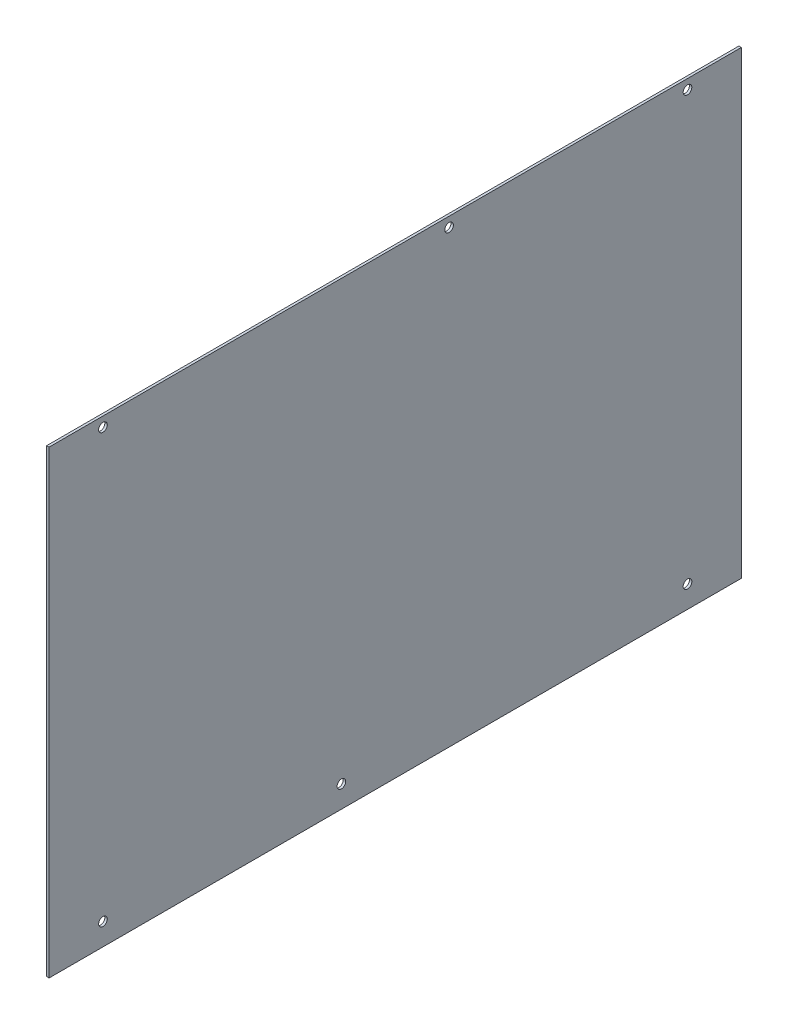
ISO-10303-21;
HEADER;
FILE_DESCRIPTION(('STEP AP214'),'2;1');
FILE_NAME('part.step','',(''),(''),'','','');
FILE_SCHEMA(('AUTOMOTIVE_DESIGN { 1 0 10303 214 1 1 1 1 }'));
ENDSEC;
DATA;
#1=APPLICATION_CONTEXT('core data for automotive mechanical design processes');
#2=APPLICATION_PROTOCOL_DEFINITION('international standard','automotive_design',2000,#1);
#3=PRODUCT_CONTEXT('',#1,'mechanical');
#4=PRODUCT('Part','Part','',(#3));
#5=PRODUCT_RELATED_PRODUCT_CATEGORY('part','',(#4));
#6=PRODUCT_DEFINITION_FORMATION('','',#4);
#7=PRODUCT_DEFINITION_CONTEXT('part definition',#1,'design');
#8=PRODUCT_DEFINITION('design','',#6,#7);
#9=PRODUCT_DEFINITION_SHAPE('','',#8);
#10=(LENGTH_UNIT() NAMED_UNIT(*) SI_UNIT(.MILLI.,.METRE.));
#11=(NAMED_UNIT(*) PLANE_ANGLE_UNIT() SI_UNIT($,.RADIAN.));
#12=(NAMED_UNIT(*) SI_UNIT($,.STERADIAN.) SOLID_ANGLE_UNIT());
#13=UNCERTAINTY_MEASURE_WITH_UNIT(LENGTH_MEASURE(1.E-05),#10,'distance_accuracy_value','');
#14=(GEOMETRIC_REPRESENTATION_CONTEXT(3) GLOBAL_UNCERTAINTY_ASSIGNED_CONTEXT((#13)) GLOBAL_UNIT_ASSIGNED_CONTEXT((#10,
#11,#12)) REPRESENTATION_CONTEXT('',''));
#15=CARTESIAN_POINT('',(0.,0.,0.));
#16=DIRECTION('',(0.,0.,1.));
#17=DIRECTION('',(1.,0.,0.));
#18=AXIS2_PLACEMENT_3D('',#15,#16,#17);
#19=CARTESIAN_POINT('',(1.6002,145.48590835,225.));
#20=DIRECTION('',(0.,0.,-1.));
#21=DIRECTION('',(0.,1.,0.));
#22=AXIS2_PLACEMENT_3D('',#19,#20,#21);
#23=PLANE('',#22);
#24=DIRECTION('',(0.,-1.,0.));
#25=VECTOR('',#24,1.);
#26=CARTESIAN_POINT('',(0.,145.48590835,225.));
#27=LINE('',#26,#25);
#28=CARTESIAN_POINT('',(0.,145.48590835,225.));
#29=VERTEX_POINT('',#28);
#30=CARTESIAN_POINT('',(0.,-153.41070835,225.));
#31=VERTEX_POINT('',#30);
#32=EDGE_CURVE('E95',#29,#31,#27,.T.);
#33=ORIENTED_EDGE('',*,*,#32,.T.);
#34=DIRECTION('',(-1.,0.,0.));
#35=VECTOR('',#34,1.);
#36=CARTESIAN_POINT('',(1.6002,-153.41070835,225.));
#37=LINE('',#36,#35);
#38=CARTESIAN_POINT('',(1.6002,-153.41070835,225.));
#39=VERTEX_POINT('',#38);
#40=EDGE_CURVE('E11',#39,#31,#37,.T.);
#41=ORIENTED_EDGE('',*,*,#40,.F.);
#42=DIRECTION('',(0.,-1.,0.));
#43=VECTOR('',#42,1.);
#44=CARTESIAN_POINT('',(1.6002,145.48590835,225.));
#45=LINE('',#44,#43);
#46=CARTESIAN_POINT('',(1.6002,145.48590835,225.));
#47=VERTEX_POINT('',#46);
#48=EDGE_CURVE('E83',#47,#39,#45,.T.);
#49=ORIENTED_EDGE('',*,*,#48,.F.);
#50=DIRECTION('',(-1.,0.,0.));
#51=VECTOR('',#50,1.);
#52=CARTESIAN_POINT('',(1.6002,145.48590835,225.));
#53=LINE('',#52,#51);
#54=EDGE_CURVE('E91',#47,#29,#53,.T.);
#55=ORIENTED_EDGE('',*,*,#54,.T.);
#56=EDGE_LOOP('',(#33,#41,#49,#55));
#57=FACE_BOUND('',#56,.T.);
#58=ADVANCED_FACE('F32',(#57),#23,.F.);
#59=CARTESIAN_POINT('',(1.6002,-153.41070835,225.));
#60=DIRECTION('',(0.,1.,0.));
#61=DIRECTION('',(0.,0.,1.));
#62=AXIS2_PLACEMENT_3D('',#59,#60,#61);
#63=PLANE('',#62);
#64=DIRECTION('',(0.,0.,-1.));
#65=VECTOR('',#64,1.);
#66=CARTESIAN_POINT('',(0.,-153.41070835,225.));
#67=LINE('',#66,#65);
#68=CARTESIAN_POINT('',(0.,-153.41070835,-225.));
#69=VERTEX_POINT('',#68);
#70=EDGE_CURVE('E87',#31,#69,#67,.T.);
#71=ORIENTED_EDGE('',*,*,#70,.T.);
#72=DIRECTION('',(-1.,0.,0.));
#73=VECTOR('',#72,1.);
#74=CARTESIAN_POINT('',(1.6002,-153.41070835,-225.));
#75=LINE('',#74,#73);
#76=CARTESIAN_POINT('',(1.6002,-153.41070835,-225.));
#77=VERTEX_POINT('',#76);
#78=EDGE_CURVE('E40',#77,#69,#75,.T.);
#79=ORIENTED_EDGE('',*,*,#78,.F.);
#80=DIRECTION('',(0.,0.,-1.));
#81=VECTOR('',#80,1.);
#82=CARTESIAN_POINT('',(1.6002,-153.41070835,225.));
#83=LINE('',#82,#81);
#84=EDGE_CURVE('E78',#39,#77,#83,.T.);
#85=ORIENTED_EDGE('',*,*,#84,.F.);
#86=ORIENTED_EDGE('',*,*,#40,.T.);
#87=EDGE_LOOP('',(#71,#79,#85,#86));
#88=FACE_BOUND('',#87,.T.);
#89=ADVANCED_FACE('F86',(#88),#63,.F.);
#90=CARTESIAN_POINT('',(1.6002,145.48590835,-225.));
#91=DIRECTION('',(0.,0.,1.));
#92=DIRECTION('',(0.,-1.,0.));
#93=AXIS2_PLACEMENT_3D('',#90,#91,#92);
#94=PLANE('',#93);
#95=DIRECTION('',(0.,1.,0.));
#96=VECTOR('',#95,1.);
#97=CARTESIAN_POINT('',(0.,145.48590835,-225.));
#98=LINE('',#97,#96);
#99=CARTESIAN_POINT('',(0.,145.48590835,-225.));
#100=VERTEX_POINT('',#99);
#101=EDGE_CURVE('E65',#69,#100,#98,.T.);
#102=ORIENTED_EDGE('',*,*,#101,.T.);
#103=DIRECTION('',(-1.,0.,0.));
#104=VECTOR('',#103,1.);
#105=CARTESIAN_POINT('',(1.6002,145.48590835,-225.));
#106=LINE('',#105,#104);
#107=CARTESIAN_POINT('',(1.6002,145.48590835,-225.));
#108=VERTEX_POINT('',#107);
#109=EDGE_CURVE('E88',#108,#100,#106,.T.);
#110=ORIENTED_EDGE('',*,*,#109,.F.);
#111=DIRECTION('',(0.,1.,0.));
#112=VECTOR('',#111,1.);
#113=CARTESIAN_POINT('',(1.6002,145.48590835,-225.));
#114=LINE('',#113,#112);
#115=EDGE_CURVE('E81',#77,#108,#114,.T.);
#116=ORIENTED_EDGE('',*,*,#115,.F.);
#117=ORIENTED_EDGE('',*,*,#78,.T.);
#118=EDGE_LOOP('',(#102,#110,#116,#117));
#119=FACE_BOUND('',#118,.T.);
#120=ADVANCED_FACE('F89',(#119),#94,.F.);
#121=CARTESIAN_POINT('',(1.6002,145.48590835,225.));
#122=DIRECTION('',(0.,-1.,0.));
#123=DIRECTION('',(0.,0.,-1.));
#124=AXIS2_PLACEMENT_3D('',#121,#122,#123);
#125=PLANE('',#124);
#126=DIRECTION('',(0.,0.,1.));
#127=VECTOR('',#126,1.);
#128=CARTESIAN_POINT('',(0.,145.48590835,225.));
#129=LINE('',#128,#127);
#130=EDGE_CURVE('E71',#100,#29,#129,.T.);
#131=ORIENTED_EDGE('',*,*,#130,.T.);
#132=ORIENTED_EDGE('',*,*,#54,.F.);
#133=DIRECTION('',(0.,0.,1.));
#134=VECTOR('',#133,1.);
#135=CARTESIAN_POINT('',(1.6002,145.48590835,225.));
#136=LINE('',#135,#134);
#137=EDGE_CURVE('E48',#108,#47,#136,.T.);
#138=ORIENTED_EDGE('',*,*,#137,.F.);
#139=ORIENTED_EDGE('',*,*,#109,.T.);
#140=EDGE_LOOP('',(#131,#132,#138,#139));
#141=FACE_BOUND('',#140,.T.);
#142=ADVANCED_FACE('F103',(#141),#125,.F.);
#143=CARTESIAN_POINT('',(1.6002,0.,0.));
#144=DIRECTION('',(1.,0.,0.));
#145=DIRECTION('',(0.,0.,-1.));
#146=AXIS2_PLACEMENT_3D('',#143,#144,#145);
#147=PLANE('',#146);
#148=CARTESIAN_POINT('',(1.6002,139.12320835,-190.));
#149=DIRECTION('',(1.,0.,0.));
#150=DIRECTION('',(0.,0.,-1.));
#151=AXIS2_PLACEMENT_3D('',#148,#149,#150);
#152=CIRCLE('',#151,2.8067);
#153=CARTESIAN_POINT('',(1.6002,139.12320835,-192.8067));
#154=VERTEX_POINT('',#153);
#155=EDGE_CURVE('E138',#154,#154,#152,.T.);
#156=ORIENTED_EDGE('',*,*,#155,.F.);
#157=EDGE_LOOP('',(#156));
#158=FACE_BOUND('',#157,.T.);
#159=CARTESIAN_POINT('',(1.6002,139.12320835,-35.));
#160=DIRECTION('',(1.,0.,0.));
#161=DIRECTION('',(0.,0.,-1.));
#162=AXIS2_PLACEMENT_3D('',#159,#160,#161);
#163=CIRCLE('',#162,2.8067);
#164=CARTESIAN_POINT('',(1.6002,139.12320835,-37.8067));
#165=VERTEX_POINT('',#164);
#166=EDGE_CURVE('E132',#165,#165,#163,.T.);
#167=ORIENTED_EDGE('',*,*,#166,.F.);
#168=EDGE_LOOP('',(#167));
#169=FACE_BOUND('',#168,.T.);
#170=CARTESIAN_POINT('',(1.6002,139.12320835,190.));
#171=DIRECTION('',(1.,0.,0.));
#172=DIRECTION('',(0.,0.,-1.));
#173=AXIS2_PLACEMENT_3D('',#170,#171,#172);
#174=CIRCLE('',#173,2.8067);
#175=CARTESIAN_POINT('',(1.6002,139.12320835,187.1933));
#176=VERTEX_POINT('',#175);
#177=EDGE_CURVE('E126',#176,#176,#174,.T.);
#178=ORIENTED_EDGE('',*,*,#177,.F.);
#179=EDGE_LOOP('',(#178));
#180=FACE_BOUND('',#179,.T.);
#181=CARTESIAN_POINT('',(1.6002,-139.12320835,190.));
#182=DIRECTION('',(1.,0.,0.));
#183=DIRECTION('',(0.,0.,-1.));
#184=AXIS2_PLACEMENT_3D('',#181,#182,#183);
#185=CIRCLE('',#184,2.8067);
#186=CARTESIAN_POINT('',(1.6002,-139.12320835,187.1933));
#187=VERTEX_POINT('',#186);
#188=EDGE_CURVE('E120',#187,#187,#185,.T.);
#189=ORIENTED_EDGE('',*,*,#188,.F.);
#190=EDGE_LOOP('',(#189));
#191=FACE_BOUND('',#190,.T.);
#192=CARTESIAN_POINT('',(1.6002,-139.12320835,35.));
#193=DIRECTION('',(1.,0.,0.));
#194=DIRECTION('',(0.,0.,-1.));
#195=AXIS2_PLACEMENT_3D('',#192,#193,#194);
#196=CIRCLE('',#195,2.8067);
#197=CARTESIAN_POINT('',(1.6002,-139.12320835,32.1933));
#198=VERTEX_POINT('',#197);
#199=EDGE_CURVE('E114',#198,#198,#196,.T.);
#200=ORIENTED_EDGE('',*,*,#199,.F.);
#201=EDGE_LOOP('',(#200));
#202=FACE_BOUND('',#201,.T.);
#203=CARTESIAN_POINT('',(1.6002,-139.12320835,-190.));
#204=DIRECTION('',(1.,0.,0.));
#205=DIRECTION('',(0.,0.,-1.));
#206=AXIS2_PLACEMENT_3D('',#203,#204,#205);
#207=CIRCLE('',#206,2.8067);
#208=CARTESIAN_POINT('',(1.6002,-139.12320835,-192.8067));
#209=VERTEX_POINT('',#208);
#210=EDGE_CURVE('E98',#209,#209,#207,.T.);
#211=ORIENTED_EDGE('',*,*,#210,.F.);
#212=EDGE_LOOP('',(#211));
#213=FACE_BOUND('',#212,.T.);
#214=ORIENTED_EDGE('',*,*,#48,.T.);
#215=ORIENTED_EDGE('',*,*,#84,.T.);
#216=ORIENTED_EDGE('',*,*,#115,.T.);
#217=ORIENTED_EDGE('',*,*,#137,.T.);
#218=EDGE_LOOP('',(#214,#215,#216,#217));
#219=FACE_BOUND('',#218,.T.);
#220=ADVANCED_FACE('F79',(#158,#169,#180,#191,#202,#213,#219),#147,.T.);
#221=CARTESIAN_POINT('',(0.,0.,0.));
#222=DIRECTION('',(1.,0.,0.));
#223=DIRECTION('',(0.,0.,-1.));
#224=AXIS2_PLACEMENT_3D('',#221,#222,#223);
#225=PLANE('',#224);
#226=CARTESIAN_POINT('',(0.,139.12320835,-190.));
#227=DIRECTION('',(-1.,0.,0.));
#228=DIRECTION('',(0.,0.,1.));
#229=AXIS2_PLACEMENT_3D('',#226,#227,#228);
#230=CIRCLE('',#229,2.8067);
#231=CARTESIAN_POINT('',(0.,139.12320835,-187.1933));
#232=VERTEX_POINT('',#231);
#233=EDGE_CURVE('E141',#232,#232,#230,.T.);
#234=ORIENTED_EDGE('',*,*,#233,.F.);
#235=EDGE_LOOP('',(#234));
#236=FACE_BOUND('',#235,.T.);
#237=CARTESIAN_POINT('',(0.,139.12320835,-35.));
#238=DIRECTION('',(-1.,0.,0.));
#239=DIRECTION('',(0.,0.,1.));
#240=AXIS2_PLACEMENT_3D('',#237,#238,#239);
#241=CIRCLE('',#240,2.8067);
#242=CARTESIAN_POINT('',(0.,139.12320835,-32.1933));
#243=VERTEX_POINT('',#242);
#244=EDGE_CURVE('E135',#243,#243,#241,.T.);
#245=ORIENTED_EDGE('',*,*,#244,.F.);
#246=EDGE_LOOP('',(#245));
#247=FACE_BOUND('',#246,.T.);
#248=CARTESIAN_POINT('',(0.,139.12320835,190.));
#249=DIRECTION('',(-1.,0.,0.));
#250=DIRECTION('',(0.,0.,1.));
#251=AXIS2_PLACEMENT_3D('',#248,#249,#250);
#252=CIRCLE('',#251,2.8067);
#253=CARTESIAN_POINT('',(0.,139.12320835,192.8067));
#254=VERTEX_POINT('',#253);
#255=EDGE_CURVE('E129',#254,#254,#252,.T.);
#256=ORIENTED_EDGE('',*,*,#255,.F.);
#257=EDGE_LOOP('',(#256));
#258=FACE_BOUND('',#257,.T.);
#259=CARTESIAN_POINT('',(0.,-139.12320835,190.));
#260=DIRECTION('',(-1.,0.,0.));
#261=DIRECTION('',(0.,0.,1.));
#262=AXIS2_PLACEMENT_3D('',#259,#260,#261);
#263=CIRCLE('',#262,2.8067);
#264=CARTESIAN_POINT('',(0.,-139.12320835,192.8067));
#265=VERTEX_POINT('',#264);
#266=EDGE_CURVE('E123',#265,#265,#263,.T.);
#267=ORIENTED_EDGE('',*,*,#266,.F.);
#268=EDGE_LOOP('',(#267));
#269=FACE_BOUND('',#268,.T.);
#270=CARTESIAN_POINT('',(0.,-139.12320835,35.));
#271=DIRECTION('',(-1.,0.,0.));
#272=DIRECTION('',(0.,0.,1.));
#273=AXIS2_PLACEMENT_3D('',#270,#271,#272);
#274=CIRCLE('',#273,2.8067);
#275=CARTESIAN_POINT('',(0.,-139.12320835,37.8067));
#276=VERTEX_POINT('',#275);
#277=EDGE_CURVE('E117',#276,#276,#274,.T.);
#278=ORIENTED_EDGE('',*,*,#277,.F.);
#279=EDGE_LOOP('',(#278));
#280=FACE_BOUND('',#279,.T.);
#281=CARTESIAN_POINT('',(0.,-139.12320835,-190.));
#282=DIRECTION('',(-1.,0.,0.));
#283=DIRECTION('',(0.,0.,1.));
#284=AXIS2_PLACEMENT_3D('',#281,#282,#283);
#285=CIRCLE('',#284,2.8067);
#286=CARTESIAN_POINT('',(0.,-139.12320835,-187.1933));
#287=VERTEX_POINT('',#286);
#288=EDGE_CURVE('E111',#287,#287,#285,.T.);
#289=ORIENTED_EDGE('',*,*,#288,.F.);
#290=EDGE_LOOP('',(#289));
#291=FACE_BOUND('',#290,.T.);
#292=ORIENTED_EDGE('',*,*,#32,.F.);
#293=ORIENTED_EDGE('',*,*,#130,.F.);
#294=ORIENTED_EDGE('',*,*,#101,.F.);
#295=ORIENTED_EDGE('',*,*,#70,.F.);
#296=EDGE_LOOP('',(#292,#293,#294,#295));
#297=FACE_BOUND('',#296,.T.);
#298=ADVANCED_FACE('F106',(#236,#247,#258,#269,#280,#291,#297),#225,.F.);
#299=CARTESIAN_POINT('',(0.,-139.12320835,-190.));
#300=DIRECTION('',(-1.,0.,0.));
#301=DIRECTION('',(0.,0.,1.));
#302=AXIS2_PLACEMENT_3D('',#299,#300,#301);
#303=CYLINDRICAL_SURFACE('',#302,2.8067);
#304=ORIENTED_EDGE('',*,*,#210,.T.);
#305=EDGE_LOOP('',(#304));
#306=FACE_BOUND('',#305,.T.);
#307=ORIENTED_EDGE('',*,*,#288,.T.);
#308=EDGE_LOOP('',(#307));
#309=FACE_BOUND('',#308,.T.);
#310=ADVANCED_FACE('F149',(#306,#309),#303,.F.);
#311=CARTESIAN_POINT('',(0.,-139.12320835,35.));
#312=DIRECTION('',(-1.,0.,0.));
#313=DIRECTION('',(0.,0.,1.));
#314=AXIS2_PLACEMENT_3D('',#311,#312,#313);
#315=CYLINDRICAL_SURFACE('',#314,2.8067);
#316=ORIENTED_EDGE('',*,*,#199,.T.);
#317=EDGE_LOOP('',(#316));
#318=FACE_BOUND('',#317,.T.);
#319=ORIENTED_EDGE('',*,*,#277,.T.);
#320=EDGE_LOOP('',(#319));
#321=FACE_BOUND('',#320,.T.);
#322=ADVANCED_FACE('F162',(#318,#321),#315,.F.);
#323=CARTESIAN_POINT('',(0.,-139.12320835,190.));
#324=DIRECTION('',(-1.,0.,0.));
#325=DIRECTION('',(0.,0.,1.));
#326=AXIS2_PLACEMENT_3D('',#323,#324,#325);
#327=CYLINDRICAL_SURFACE('',#326,2.8067);
#328=ORIENTED_EDGE('',*,*,#188,.T.);
#329=EDGE_LOOP('',(#328));
#330=FACE_BOUND('',#329,.T.);
#331=ORIENTED_EDGE('',*,*,#266,.T.);
#332=EDGE_LOOP('',(#331));
#333=FACE_BOUND('',#332,.T.);
#334=ADVANCED_FACE('F168',(#330,#333),#327,.F.);
#335=CARTESIAN_POINT('',(0.,139.12320835,190.));
#336=DIRECTION('',(-1.,0.,0.));
#337=DIRECTION('',(0.,0.,1.));
#338=AXIS2_PLACEMENT_3D('',#335,#336,#337);
#339=CYLINDRICAL_SURFACE('',#338,2.8067);
#340=ORIENTED_EDGE('',*,*,#177,.T.);
#341=EDGE_LOOP('',(#340));
#342=FACE_BOUND('',#341,.T.);
#343=ORIENTED_EDGE('',*,*,#255,.T.);
#344=EDGE_LOOP('',(#343));
#345=FACE_BOUND('',#344,.T.);
#346=ADVANCED_FACE('F201',(#342,#345),#339,.F.);
#347=CARTESIAN_POINT('',(0.,139.12320835,-35.));
#348=DIRECTION('',(-1.,0.,0.));
#349=DIRECTION('',(0.,0.,1.));
#350=AXIS2_PLACEMENT_3D('',#347,#348,#349);
#351=CYLINDRICAL_SURFACE('',#350,2.8067);
#352=ORIENTED_EDGE('',*,*,#166,.T.);
#353=EDGE_LOOP('',(#352));
#354=FACE_BOUND('',#353,.T.);
#355=ORIENTED_EDGE('',*,*,#244,.T.);
#356=EDGE_LOOP('',(#355));
#357=FACE_BOUND('',#356,.T.);
#358=ADVANCED_FACE('F206',(#354,#357),#351,.F.);
#359=CARTESIAN_POINT('',(0.,139.12320835,-190.));
#360=DIRECTION('',(-1.,0.,0.));
#361=DIRECTION('',(0.,0.,1.));
#362=AXIS2_PLACEMENT_3D('',#359,#360,#361);
#363=CYLINDRICAL_SURFACE('',#362,2.8067);
#364=ORIENTED_EDGE('',*,*,#155,.T.);
#365=EDGE_LOOP('',(#364));
#366=FACE_BOUND('',#365,.T.);
#367=ORIENTED_EDGE('',*,*,#233,.T.);
#368=EDGE_LOOP('',(#367));
#369=FACE_BOUND('',#368,.T.);
#370=ADVANCED_FACE('F145',(#366,#369),#363,.F.);
#371=CLOSED_SHELL('',(#58,#89,#120,#142,#220,#298,#310,#322,#334,#346,#358,#370));
#372=MANIFOLD_SOLID_BREP('B2',#371);
#373=ADVANCED_BREP_SHAPE_REPRESENTATION('',(#18,#372),#14);
#374=SHAPE_DEFINITION_REPRESENTATION(#9,#373);
ENDSEC;
END-ISO-10303-21;
